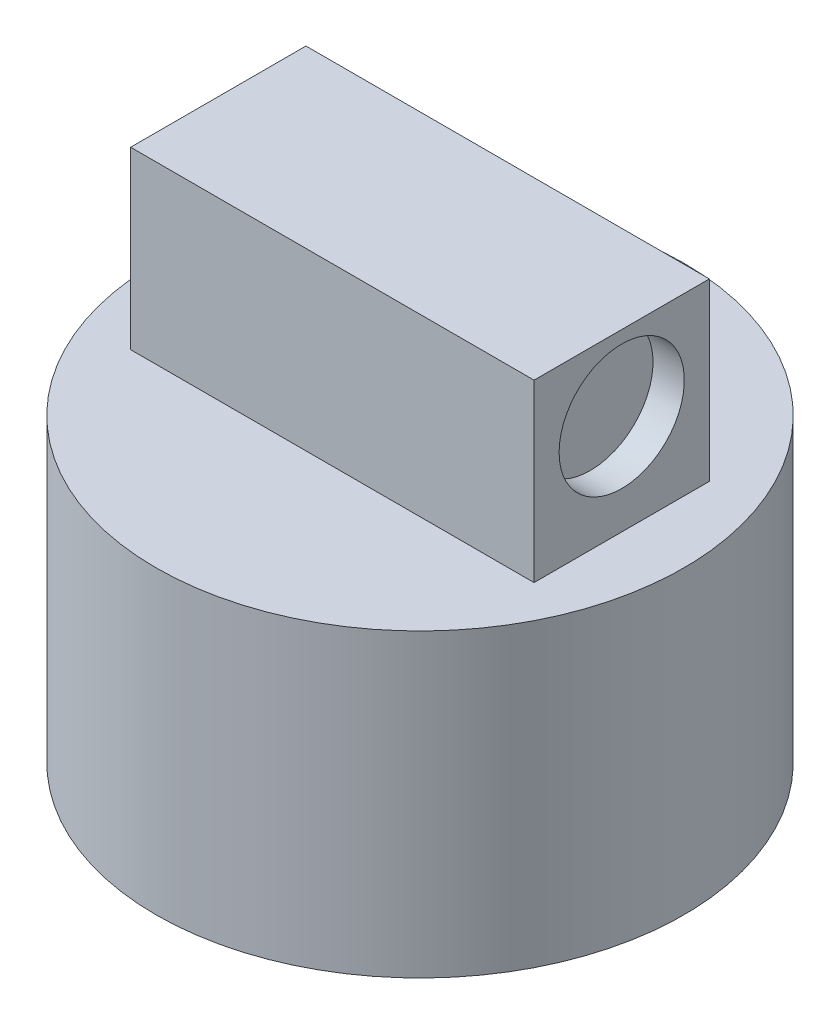
ISO-10303-21;
HEADER;
FILE_DESCRIPTION(('STEP AP214'),'2;1');
FILE_NAME('part.step','',(''),(''),'','','');
FILE_SCHEMA(('AUTOMOTIVE_DESIGN { 1 0 10303 214 1 1 1 1 }'));
ENDSEC;
DATA;
#1=APPLICATION_CONTEXT('core data for automotive mechanical design processes');
#2=APPLICATION_PROTOCOL_DEFINITION('international standard','automotive_design',2000,#1);
#3=PRODUCT_CONTEXT('',#1,'mechanical');
#4=PRODUCT('Part','Part','',(#3));
#5=PRODUCT_RELATED_PRODUCT_CATEGORY('part','',(#4));
#6=PRODUCT_DEFINITION_FORMATION('','',#4);
#7=PRODUCT_DEFINITION_CONTEXT('part definition',#1,'design');
#8=PRODUCT_DEFINITION('design','',#6,#7);
#9=PRODUCT_DEFINITION_SHAPE('','',#8);
#10=(LENGTH_UNIT() NAMED_UNIT(*) SI_UNIT(.MILLI.,.METRE.));
#11=(NAMED_UNIT(*) PLANE_ANGLE_UNIT() SI_UNIT($,.RADIAN.));
#12=(NAMED_UNIT(*) SI_UNIT($,.STERADIAN.) SOLID_ANGLE_UNIT());
#13=UNCERTAINTY_MEASURE_WITH_UNIT(LENGTH_MEASURE(1.E-05),#10,'distance_accuracy_value','');
#14=(GEOMETRIC_REPRESENTATION_CONTEXT(3) GLOBAL_UNCERTAINTY_ASSIGNED_CONTEXT((#13)) GLOBAL_UNIT_ASSIGNED_CONTEXT((#10,
#11,#12)) REPRESENTATION_CONTEXT('',''));
#15=CARTESIAN_POINT('',(0.,0.,0.));
#16=DIRECTION('',(0.,0.,1.));
#17=DIRECTION('',(1.,0.,0.));
#18=AXIS2_PLACEMENT_3D('',#15,#16,#17);
#19=CARTESIAN_POINT('',(0.,48.,-5.95140074906367));
#20=DIRECTION('',(0.,-1.,0.));
#21=DIRECTION('',(0.,0.,-1.));
#22=AXIS2_PLACEMENT_3D('',#19,#20,#21);
#23=CYLINDRICAL_SURFACE('',#22,42.15);
#24=CARTESIAN_POINT('',(0.,48.,-5.95140074906367));
#25=DIRECTION('',(0.,1.,0.));
#26=DIRECTION('',(0.,0.,1.));
#27=AXIS2_PLACEMENT_3D('',#24,#25,#26);
#28=CIRCLE('',#27,42.15);
#29=CARTESIAN_POINT('',(0.,48.,36.1985992509363));
#30=VERTEX_POINT('',#29);
#31=EDGE_CURVE('E11',#30,#30,#28,.T.);
#32=ORIENTED_EDGE('',*,*,#31,.F.);
#33=EDGE_LOOP('',(#32));
#34=FACE_BOUND('',#33,.T.);
#35=CARTESIAN_POINT('',(0.,0.,-5.95140074906367));
#36=DIRECTION('',(0.,1.,0.));
#37=DIRECTION('',(0.,0.,1.));
#38=AXIS2_PLACEMENT_3D('',#35,#36,#37);
#39=CIRCLE('',#38,42.15);
#40=CARTESIAN_POINT('',(0.,0.,36.1985992509363));
#41=VERTEX_POINT('',#40);
#42=EDGE_CURVE('E48',#41,#41,#39,.T.);
#43=ORIENTED_EDGE('',*,*,#42,.T.);
#44=EDGE_LOOP('',(#43));
#45=FACE_BOUND('',#44,.T.);
#46=ADVANCED_FACE('F45',(#34,#45),#23,.T.);
#47=CARTESIAN_POINT('',(0.,48.,-5.95140074906367));
#48=DIRECTION('',(0.,1.,0.));
#49=DIRECTION('',(0.,0.,1.));
#50=AXIS2_PLACEMENT_3D('',#47,#48,#49);
#51=PLANE('',#50);
#52=DIRECTION('',(0.,0.,1.));
#53=VECTOR('',#52,1.);
#54=CARTESIAN_POINT('',(-32.215,48.,8.04859925093634));
#55=LINE('',#54,#53);
#56=CARTESIAN_POINT('',(-32.215,48.,-19.9514007490637));
#57=VERTEX_POINT('',#56);
#58=CARTESIAN_POINT('',(-32.215,48.,8.04859925093634));
#59=VERTEX_POINT('',#58);
#60=EDGE_CURVE('E60',#57,#59,#55,.T.);
#61=ORIENTED_EDGE('',*,*,#60,.F.);
#62=DIRECTION('',(-1.,0.,0.));
#63=VECTOR('',#62,1.);
#64=CARTESIAN_POINT('',(32.215,48.,-19.9514007490637));
#65=LINE('',#64,#63);
#66=CARTESIAN_POINT('',(32.215,48.,-19.9514007490637));
#67=VERTEX_POINT('',#66);
#68=EDGE_CURVE('E64',#67,#57,#65,.T.);
#69=ORIENTED_EDGE('',*,*,#68,.F.);
#70=DIRECTION('',(0.,0.,-1.));
#71=VECTOR('',#70,1.);
#72=CARTESIAN_POINT('',(32.215,48.,8.04859925093633));
#73=LINE('',#72,#71);
#74=CARTESIAN_POINT('',(32.215,48.,8.04859925093633));
#75=VERTEX_POINT('',#74);
#76=EDGE_CURVE('E124',#75,#67,#73,.T.);
#77=ORIENTED_EDGE('',*,*,#76,.F.);
#78=DIRECTION('',(1.,0.,0.));
#79=VECTOR('',#78,1.);
#80=CARTESIAN_POINT('',(32.215,48.,8.04859925093633));
#81=LINE('',#80,#79);
#82=EDGE_CURVE('E127',#59,#75,#81,.T.);
#83=ORIENTED_EDGE('',*,*,#82,.F.);
#84=EDGE_LOOP('',(#61,#69,#77,#83));
#85=FACE_BOUND('',#84,.T.);
#86=ORIENTED_EDGE('',*,*,#31,.T.);
#87=EDGE_LOOP('',(#86));
#88=FACE_BOUND('',#87,.T.);
#89=ADVANCED_FACE('F165',(#85,#88),#51,.T.);
#90=CARTESIAN_POINT('',(0.,0.,-5.95140074906367));
#91=DIRECTION('',(0.,1.,0.));
#92=DIRECTION('',(0.,0.,1.));
#93=AXIS2_PLACEMENT_3D('',#90,#91,#92);
#94=PLANE('',#93);
#95=ORIENTED_EDGE('',*,*,#42,.F.);
#96=EDGE_LOOP('',(#95));
#97=FACE_BOUND('',#96,.T.);
#98=ADVANCED_FACE('F170',(#97),#94,.F.);
#99=CARTESIAN_POINT('',(-32.215,76.,8.04859925093634));
#100=DIRECTION('',(1.,0.,0.));
#101=DIRECTION('',(0.,0.,-1.));
#102=AXIS2_PLACEMENT_3D('',#99,#100,#101);
#103=PLANE('',#102);
#104=CARTESIAN_POINT('',(-32.215,64.,-5.95140074906366));
#105=DIRECTION('',(-1.,0.,0.));
#106=DIRECTION('',(0.,0.,1.));
#107=AXIS2_PLACEMENT_3D('',#104,#105,#106);
#108=CIRCLE('',#107,10.);
#109=CARTESIAN_POINT('',(-32.215,64.,4.04859925093634));
#110=VERTEX_POINT('',#109);
#111=EDGE_CURVE('E137',#110,#110,#108,.T.);
#112=ORIENTED_EDGE('',*,*,#111,.F.);
#113=EDGE_LOOP('',(#112));
#114=FACE_BOUND('',#113,.T.);
#115=ORIENTED_EDGE('',*,*,#60,.T.);
#116=DIRECTION('',(0.,-1.,0.));
#117=VECTOR('',#116,1.);
#118=CARTESIAN_POINT('',(-32.215,76.,8.04859925093634));
#119=LINE('',#118,#117);
#120=CARTESIAN_POINT('',(-32.215,76.,8.04859925093634));
#121=VERTEX_POINT('',#120);
#122=EDGE_CURVE('E89',#121,#59,#119,.T.);
#123=ORIENTED_EDGE('',*,*,#122,.F.);
#124=DIRECTION('',(0.,0.,1.));
#125=VECTOR('',#124,1.);
#126=CARTESIAN_POINT('',(-32.215,76.,8.04859925093634));
#127=LINE('',#126,#125);
#128=CARTESIAN_POINT('',(-32.215,76.,-19.9514007490637));
#129=VERTEX_POINT('',#128);
#130=EDGE_CURVE('E96',#129,#121,#127,.T.);
#131=ORIENTED_EDGE('',*,*,#130,.F.);
#132=DIRECTION('',(0.,-1.,0.));
#133=VECTOR('',#132,1.);
#134=CARTESIAN_POINT('',(-32.215,76.,-19.9514007490637));
#135=LINE('',#134,#133);
#136=EDGE_CURVE('E119',#129,#57,#135,.T.);
#137=ORIENTED_EDGE('',*,*,#136,.T.);
#138=EDGE_LOOP('',(#115,#123,#131,#137));
#139=FACE_BOUND('',#138,.T.);
#140=ADVANCED_FACE('F107',(#114,#139),#103,.F.);
#141=CARTESIAN_POINT('',(32.215,76.,8.04859925093633));
#142=DIRECTION('',(0.,0.,-1.));
#143=DIRECTION('',(-1.,0.,0.));
#144=AXIS2_PLACEMENT_3D('',#141,#142,#143);
#145=PLANE('',#144);
#146=ORIENTED_EDGE('',*,*,#82,.T.);
#147=DIRECTION('',(0.,-1.,0.));
#148=VECTOR('',#147,1.);
#149=CARTESIAN_POINT('',(32.215,76.,8.04859925093633));
#150=LINE('',#149,#148);
#151=CARTESIAN_POINT('',(32.215,76.,8.04859925093633));
#152=VERTEX_POINT('',#151);
#153=EDGE_CURVE('E91',#152,#75,#150,.T.);
#154=ORIENTED_EDGE('',*,*,#153,.F.);
#155=DIRECTION('',(1.,0.,0.));
#156=VECTOR('',#155,1.);
#157=CARTESIAN_POINT('',(32.215,76.,8.04859925093633));
#158=LINE('',#157,#156);
#159=EDGE_CURVE('E84',#121,#152,#158,.T.);
#160=ORIENTED_EDGE('',*,*,#159,.F.);
#161=ORIENTED_EDGE('',*,*,#122,.T.);
#162=EDGE_LOOP('',(#146,#154,#160,#161));
#163=FACE_BOUND('',#162,.T.);
#164=ADVANCED_FACE('F87',(#163),#145,.F.);
#165=CARTESIAN_POINT('',(32.215,76.,8.04859925093633));
#166=DIRECTION('',(-1.,0.,0.));
#167=DIRECTION('',(0.,0.,1.));
#168=AXIS2_PLACEMENT_3D('',#165,#166,#167);
#169=PLANE('',#168);
#170=CARTESIAN_POINT('',(32.215,64.,-5.95140074906366));
#171=DIRECTION('',(-1.,0.,0.));
#172=DIRECTION('',(0.,0.,1.));
#173=AXIS2_PLACEMENT_3D('',#170,#171,#172);
#174=CIRCLE('',#173,10.);
#175=CARTESIAN_POINT('',(32.215,64.,4.04859925093634));
#176=VERTEX_POINT('',#175);
#177=EDGE_CURVE('E145',#176,#176,#174,.T.);
#178=ORIENTED_EDGE('',*,*,#177,.T.);
#179=EDGE_LOOP('',(#178));
#180=FACE_BOUND('',#179,.T.);
#181=ORIENTED_EDGE('',*,*,#76,.T.);
#182=DIRECTION('',(0.,-1.,0.));
#183=VECTOR('',#182,1.);
#184=CARTESIAN_POINT('',(32.215,76.,-19.9514007490637));
#185=LINE('',#184,#183);
#186=CARTESIAN_POINT('',(32.215,76.,-19.9514007490637));
#187=VERTEX_POINT('',#186);
#188=EDGE_CURVE('E113',#187,#67,#185,.T.);
#189=ORIENTED_EDGE('',*,*,#188,.F.);
#190=DIRECTION('',(0.,0.,-1.));
#191=VECTOR('',#190,1.);
#192=CARTESIAN_POINT('',(32.215,76.,8.04859925093633));
#193=LINE('',#192,#191);
#194=EDGE_CURVE('E95',#152,#187,#193,.T.);
#195=ORIENTED_EDGE('',*,*,#194,.F.);
#196=ORIENTED_EDGE('',*,*,#153,.T.);
#197=EDGE_LOOP('',(#181,#189,#195,#196));
#198=FACE_BOUND('',#197,.T.);
#199=ADVANCED_FACE('F185',(#180,#198),#169,.F.);
#200=CARTESIAN_POINT('',(32.215,76.,-19.9514007490637));
#201=DIRECTION('',(0.,0.,1.));
#202=DIRECTION('',(1.,0.,0.));
#203=AXIS2_PLACEMENT_3D('',#200,#201,#202);
#204=PLANE('',#203);
#205=ORIENTED_EDGE('',*,*,#68,.T.);
#206=ORIENTED_EDGE('',*,*,#136,.F.);
#207=DIRECTION('',(-1.,0.,0.));
#208=VECTOR('',#207,1.);
#209=CARTESIAN_POINT('',(32.215,76.,-19.9514007490637));
#210=LINE('',#209,#208);
#211=EDGE_CURVE('E101',#187,#129,#210,.T.);
#212=ORIENTED_EDGE('',*,*,#211,.F.);
#213=ORIENTED_EDGE('',*,*,#188,.T.);
#214=EDGE_LOOP('',(#205,#206,#212,#213));
#215=FACE_BOUND('',#214,.T.);
#216=ADVANCED_FACE('F188',(#215),#204,.F.);
#217=CARTESIAN_POINT('',(0.,76.,0.));
#218=DIRECTION('',(0.,1.,0.));
#219=DIRECTION('',(0.,0.,1.));
#220=AXIS2_PLACEMENT_3D('',#217,#218,#219);
#221=PLANE('',#220);
#222=ORIENTED_EDGE('',*,*,#130,.T.);
#223=ORIENTED_EDGE('',*,*,#159,.T.);
#224=ORIENTED_EDGE('',*,*,#194,.T.);
#225=ORIENTED_EDGE('',*,*,#211,.T.);
#226=EDGE_LOOP('',(#222,#223,#224,#225));
#227=FACE_BOUND('',#226,.T.);
#228=ADVANCED_FACE('F99',(#227),#221,.T.);
#229=CARTESIAN_POINT('',(-27.215,64.,-5.95140074906366));
#230=DIRECTION('',(-1.,0.,0.));
#231=DIRECTION('',(0.,0.,1.));
#232=AXIS2_PLACEMENT_3D('',#229,#230,#231);
#233=CYLINDRICAL_SURFACE('',#232,10.);
#234=CARTESIAN_POINT('',(-27.215,64.,-5.95140074906366));
#235=DIRECTION('',(-1.,0.,0.));
#236=DIRECTION('',(0.,0.,1.));
#237=AXIS2_PLACEMENT_3D('',#234,#235,#236);
#238=CIRCLE('',#237,10.);
#239=CARTESIAN_POINT('',(-27.215,64.,4.04859925093634));
#240=VERTEX_POINT('',#239);
#241=EDGE_CURVE('E132',#240,#240,#238,.T.);
#242=ORIENTED_EDGE('',*,*,#241,.F.);
#243=EDGE_LOOP('',(#242));
#244=FACE_BOUND('',#243,.T.);
#245=ORIENTED_EDGE('',*,*,#111,.T.);
#246=EDGE_LOOP('',(#245));
#247=FACE_BOUND('',#246,.T.);
#248=ADVANCED_FACE('F195',(#244,#247),#233,.F.);
#249=CARTESIAN_POINT('',(-27.215,0.,0.));
#250=DIRECTION('',(-1.,0.,0.));
#251=DIRECTION('',(0.,0.,1.));
#252=AXIS2_PLACEMENT_3D('',#249,#250,#251);
#253=PLANE('',#252);
#254=ORIENTED_EDGE('',*,*,#241,.T.);
#255=EDGE_LOOP('',(#254));
#256=FACE_BOUND('',#255,.T.);
#257=ADVANCED_FACE('F162',(#256),#253,.T.);
#258=CARTESIAN_POINT('',(27.215,64.,-5.95140074906366));
#259=DIRECTION('',(1.,0.,0.));
#260=DIRECTION('',(0.,0.,-1.));
#261=AXIS2_PLACEMENT_3D('',#258,#259,#260);
#262=CYLINDRICAL_SURFACE('',#261,10.);
#263=CARTESIAN_POINT('',(27.215,64.,-5.95140074906366));
#264=DIRECTION('',(-1.,0.,0.));
#265=DIRECTION('',(0.,0.,1.));
#266=AXIS2_PLACEMENT_3D('',#263,#264,#265);
#267=CIRCLE('',#266,10.);
#268=CARTESIAN_POINT('',(27.215,64.,4.04859925093634));
#269=VERTEX_POINT('',#268);
#270=EDGE_CURVE('E141',#269,#269,#267,.T.);
#271=ORIENTED_EDGE('',*,*,#270,.T.);
#272=EDGE_LOOP('',(#271));
#273=FACE_BOUND('',#272,.T.);
#274=ORIENTED_EDGE('',*,*,#177,.F.);
#275=EDGE_LOOP('',(#274));
#276=FACE_BOUND('',#275,.T.);
#277=ADVANCED_FACE('F153',(#273,#276),#262,.F.);
#278=CARTESIAN_POINT('',(27.215,0.,0.));
#279=DIRECTION('',(1.,0.,0.));
#280=DIRECTION('',(0.,0.,1.));
#281=AXIS2_PLACEMENT_3D('',#278,#279,#280);
#282=PLANE('',#281);
#283=ORIENTED_EDGE('',*,*,#270,.F.);
#284=EDGE_LOOP('',(#283));
#285=FACE_BOUND('',#284,.T.);
#286=ADVANCED_FACE('F156',(#285),#282,.T.);
#287=CLOSED_SHELL('',(#46,#89,#98,#140,#164,#199,#216,#228,#248,#257,#277,#286));
#288=MANIFOLD_SOLID_BREP('B2',#287);
#289=ADVANCED_BREP_SHAPE_REPRESENTATION('',(#18,#288),#14);
#290=SHAPE_DEFINITION_REPRESENTATION(#9,#289);
ENDSEC;
END-ISO-10303-21;
